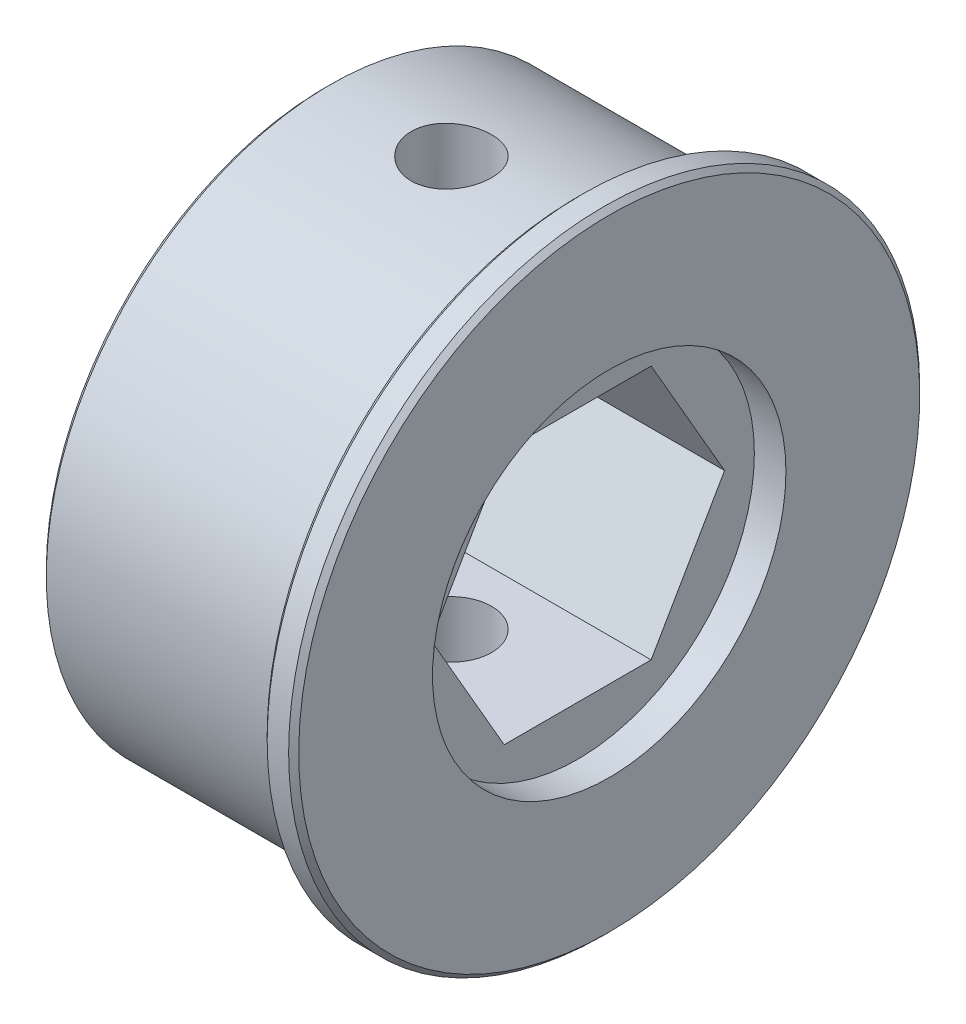
ISO-10303-21;
HEADER;
FILE_DESCRIPTION(('STEP AP214'),'2;1');
FILE_NAME('part.step','',(''),(''),'','','');
FILE_SCHEMA(('AUTOMOTIVE_DESIGN { 1 0 10303 214 1 1 1 1 }'));
ENDSEC;
DATA;
#1=APPLICATION_CONTEXT('core data for automotive mechanical design processes');
#2=APPLICATION_PROTOCOL_DEFINITION('international standard','automotive_design',2000,#1);
#3=PRODUCT_CONTEXT('',#1,'mechanical');
#4=PRODUCT('Part','Part','',(#3));
#5=PRODUCT_RELATED_PRODUCT_CATEGORY('part','',(#4));
#6=PRODUCT_DEFINITION_FORMATION('','',#4);
#7=PRODUCT_DEFINITION_CONTEXT('part definition',#1,'design');
#8=PRODUCT_DEFINITION('design','',#6,#7);
#9=PRODUCT_DEFINITION_SHAPE('','',#8);
#10=(LENGTH_UNIT() NAMED_UNIT(*) SI_UNIT(.MILLI.,.METRE.));
#11=(NAMED_UNIT(*) PLANE_ANGLE_UNIT() SI_UNIT($,.RADIAN.));
#12=(NAMED_UNIT(*) SI_UNIT($,.STERADIAN.) SOLID_ANGLE_UNIT());
#13=UNCERTAINTY_MEASURE_WITH_UNIT(LENGTH_MEASURE(1.E-05),#10,'distance_accuracy_value','');
#14=(GEOMETRIC_REPRESENTATION_CONTEXT(3) GLOBAL_UNCERTAINTY_ASSIGNED_CONTEXT((#13)) GLOBAL_UNIT_ASSIGNED_CONTEXT((#10,
#11,#12)) REPRESENTATION_CONTEXT('',''));
#15=CARTESIAN_POINT('',(0.,0.,0.));
#16=DIRECTION('',(0.,0.,1.));
#17=DIRECTION('',(1.,0.,0.));
#18=AXIS2_PLACEMENT_3D('',#15,#16,#17);
#19=CARTESIAN_POINT('',(1.5875,0.,0.));
#20=DIRECTION('',(1.,0.,0.));
#21=DIRECTION('',(0.,0.,-1.));
#22=AXIS2_PLACEMENT_3D('',#19,#20,#21);
#23=PLANE('',#22);
#24=CARTESIAN_POINT('',(1.5875,0.,0.));
#25=DIRECTION('',(1.,0.,0.));
#26=DIRECTION('',(0.,0.,-1.));
#27=AXIS2_PLACEMENT_3D('',#24,#25,#26);
#28=CIRCLE('',#27,8.89);
#29=CARTESIAN_POINT('',(1.5875,0.,-8.89));
#30=VERTEX_POINT('',#29);
#31=EDGE_CURVE('E27',#30,#30,#28,.F.);
#32=ORIENTED_EDGE('',*,*,#31,.T.);
#33=EDGE_LOOP('',(#32));
#34=FACE_BOUND('',#33,.T.);
#35=CARTESIAN_POINT('',(1.5875,0.,0.));
#36=DIRECTION('',(-1.,0.,0.));
#37=DIRECTION('',(0.,-1.,0.));
#38=AXIS2_PLACEMENT_3D('',#35,#36,#37);
#39=CIRCLE('',#38,15.621);
#40=CARTESIAN_POINT('',(1.5875,-15.621,0.));
#41=VERTEX_POINT('',#40);
#42=EDGE_CURVE('E167',#41,#41,#39,.T.);
#43=ORIENTED_EDGE('',*,*,#42,.F.);
#44=EDGE_LOOP('',(#43));
#45=FACE_BOUND('',#44,.T.);
#46=ADVANCED_FACE('F24',(#34,#45),#23,.T.);
#47=CARTESIAN_POINT('',(-26.7322171389936,0.,0.));
#48=DIRECTION('',(1.,0.,0.));
#49=DIRECTION('',(0.,0.,-1.));
#50=AXIS2_PLACEMENT_3D('',#47,#48,#49);
#51=CYLINDRICAL_SURFACE('',#50,8.89);
#52=CARTESIAN_POINT('',(0.,0.,0.));
#53=DIRECTION('',(1.,0.,0.));
#54=DIRECTION('',(0.,0.,-1.));
#55=AXIS2_PLACEMENT_3D('',#52,#53,#54);
#56=CIRCLE('',#55,8.89);
#57=CARTESIAN_POINT('',(0.,0.,-8.89));
#58=VERTEX_POINT('',#57);
#59=EDGE_CURVE('E90',#58,#58,#56,.T.);
#60=ORIENTED_EDGE('',*,*,#59,.F.);
#61=EDGE_LOOP('',(#60));
#62=FACE_BOUND('',#61,.T.);
#63=ORIENTED_EDGE('',*,*,#31,.F.);
#64=EDGE_LOOP('',(#63));
#65=FACE_BOUND('',#64,.T.);
#66=ADVANCED_FACE('F176',(#62,#65),#51,.F.);
#67=CARTESIAN_POINT('',(1.3335,0.,0.));
#68=DIRECTION('',(-1.,0.,0.));
#69=DIRECTION('',(0.,-1.,0.));
#70=AXIS2_PLACEMENT_3D('',#67,#68,#69);
#71=CONICAL_SURFACE('',#70,15.875,0.785398163397449);
#72=ORIENTED_EDGE('',*,*,#42,.T.);
#73=EDGE_LOOP('',(#72));
#74=FACE_BOUND('',#73,.T.);
#75=CARTESIAN_POINT('',(1.3335,0.,0.));
#76=DIRECTION('',(-1.,0.,0.));
#77=DIRECTION('',(0.,0.,1.));
#78=AXIS2_PLACEMENT_3D('',#75,#76,#77);
#79=CIRCLE('',#78,15.875);
#80=CARTESIAN_POINT('',(1.3335,0.,15.875));
#81=VERTEX_POINT('',#80);
#82=EDGE_CURVE('E108',#81,#81,#79,.T.);
#83=ORIENTED_EDGE('',*,*,#82,.F.);
#84=EDGE_LOOP('',(#83));
#85=FACE_BOUND('',#84,.T.);
#86=ADVANCED_FACE('F178',(#74,#85),#71,.T.);
#87=CARTESIAN_POINT('',(0.,0.,0.));
#88=DIRECTION('',(1.,0.,0.));
#89=DIRECTION('',(0.,0.,-1.));
#90=AXIS2_PLACEMENT_3D('',#87,#88,#89);
#91=PLANE('',#90);
#92=DIRECTION('',(0.,0.,1.));
#93=VECTOR('',#92,1.);
#94=CARTESIAN_POINT('',(0.,6.4008,-3.69550360302896));
#95=LINE('',#94,#93);
#96=CARTESIAN_POINT('',(0.,6.4008,3.69550360302896));
#97=VERTEX_POINT('',#96);
#98=CARTESIAN_POINT('',(0.,6.4008,-3.69550360302896));
#99=VERTEX_POINT('',#98);
#100=EDGE_CURVE('E398',#97,#99,#95,.F.);
#101=ORIENTED_EDGE('',*,*,#100,.T.);
#102=DIRECTION('',(0.,0.866025403784439,0.5));
#103=VECTOR('',#102,1.);
#104=CARTESIAN_POINT('',(0.,0.,-7.39100720605791));
#105=LINE('',#104,#103);
#106=CARTESIAN_POINT('',(0.,0.,-7.39100720605791));
#107=VERTEX_POINT('',#106);
#108=EDGE_CURVE('E74',#99,#107,#105,.F.);
#109=ORIENTED_EDGE('',*,*,#108,.T.);
#110=DIRECTION('',(0.,0.866025403784439,-0.5));
#111=VECTOR('',#110,1.);
#112=CARTESIAN_POINT('',(0.,-6.4008,-3.69550360302896));
#113=LINE('',#112,#111);
#114=CARTESIAN_POINT('',(0.,-6.4008,-3.69550360302896));
#115=VERTEX_POINT('',#114);
#116=EDGE_CURVE('E111',#107,#115,#113,.F.);
#117=ORIENTED_EDGE('',*,*,#116,.T.);
#118=DIRECTION('',(0.,0.,-1.));
#119=VECTOR('',#118,1.);
#120=CARTESIAN_POINT('',(0.,-6.4008,3.69550360302896));
#121=LINE('',#120,#119);
#122=CARTESIAN_POINT('',(0.,-6.4008,3.69550360302896));
#123=VERTEX_POINT('',#122);
#124=EDGE_CURVE('E86',#115,#123,#121,.F.);
#125=ORIENTED_EDGE('',*,*,#124,.T.);
#126=DIRECTION('',(0.,-0.866025403784439,-0.5));
#127=VECTOR('',#126,1.);
#128=CARTESIAN_POINT('',(0.,0.,7.39100720605791));
#129=LINE('',#128,#127);
#130=CARTESIAN_POINT('',(0.,0.,7.39100720605791));
#131=VERTEX_POINT('',#130);
#132=EDGE_CURVE('E78',#123,#131,#129,.F.);
#133=ORIENTED_EDGE('',*,*,#132,.T.);
#134=DIRECTION('',(0.,-0.866025403784439,0.5));
#135=VECTOR('',#134,1.);
#136=CARTESIAN_POINT('',(0.,6.4008,3.69550360302896));
#137=LINE('',#136,#135);
#138=EDGE_CURVE('E83',#131,#97,#137,.F.);
#139=ORIENTED_EDGE('',*,*,#138,.T.);
#140=EDGE_LOOP('',(#101,#109,#117,#125,#133,#139));
#141=FACE_BOUND('',#140,.T.);
#142=ORIENTED_EDGE('',*,*,#59,.T.);
#143=EDGE_LOOP('',(#142));
#144=FACE_BOUND('',#143,.T.);
#145=ADVANCED_FACE('F80',(#141,#144),#91,.T.);
#146=CARTESIAN_POINT('',(-12.7,0.,7.39100720605791));
#147=DIRECTION('',(0.,-0.5,0.866025403784439));
#148=DIRECTION('',(0.,-0.866025403784439,-0.5));
#149=AXIS2_PLACEMENT_3D('',#146,#147,#148);
#150=PLANE('',#149);
#151=DIRECTION('',(1.,0.,0.));
#152=VECTOR('',#151,1.);
#153=CARTESIAN_POINT('',(-12.7,-6.4008,3.69550360302896));
#154=LINE('',#153,#152);
#155=CARTESIAN_POINT('',(-12.7,-6.4008,3.69550360302896));
#156=VERTEX_POINT('',#155);
#157=EDGE_CURVE('E110',#123,#156,#154,.F.);
#158=ORIENTED_EDGE('',*,*,#157,.T.);
#159=DIRECTION('',(0.,0.866025403784439,0.5));
#160=VECTOR('',#159,1.);
#161=CARTESIAN_POINT('',(-12.7,-6.4008,3.69550360302896));
#162=LINE('',#161,#160);
#163=CARTESIAN_POINT('',(-12.7,0.,7.39100720605791));
#164=VERTEX_POINT('',#163);
#165=EDGE_CURVE('E95',#156,#164,#162,.T.);
#166=ORIENTED_EDGE('',*,*,#165,.T.);
#167=DIRECTION('',(1.,0.,0.));
#168=VECTOR('',#167,1.);
#169=CARTESIAN_POINT('',(-12.7,0.,7.39100720605791));
#170=LINE('',#169,#168);
#171=EDGE_CURVE('E89',#164,#131,#170,.T.);
#172=ORIENTED_EDGE('',*,*,#171,.T.);
#173=ORIENTED_EDGE('',*,*,#132,.F.);
#174=EDGE_LOOP('',(#158,#166,#172,#173));
#175=FACE_BOUND('',#174,.T.);
#176=ADVANCED_FACE('F93',(#175),#150,.F.);
#177=CARTESIAN_POINT('',(-12.7,6.4008,3.69550360302896));
#178=DIRECTION('',(0.,0.5,0.866025403784439));
#179=DIRECTION('',(0.,-0.866025403784439,0.5));
#180=AXIS2_PLACEMENT_3D('',#177,#178,#179);
#181=PLANE('',#180);
#182=ORIENTED_EDGE('',*,*,#171,.F.);
#183=DIRECTION('',(0.,0.866025403784439,-0.5));
#184=VECTOR('',#183,1.);
#185=CARTESIAN_POINT('',(-12.7,0.,7.39100720605791));
#186=LINE('',#185,#184);
#187=CARTESIAN_POINT('',(-12.7,6.4008,3.69550360302896));
#188=VERTEX_POINT('',#187);
#189=EDGE_CURVE('E401',#164,#188,#186,.T.);
#190=ORIENTED_EDGE('',*,*,#189,.T.);
#191=DIRECTION('',(1.,0.,0.));
#192=VECTOR('',#191,1.);
#193=CARTESIAN_POINT('',(-12.7,6.4008,3.69550360302896));
#194=LINE('',#193,#192);
#195=EDGE_CURVE('E101',#188,#97,#194,.T.);
#196=ORIENTED_EDGE('',*,*,#195,.T.);
#197=ORIENTED_EDGE('',*,*,#138,.F.);
#198=EDGE_LOOP('',(#182,#190,#196,#197));
#199=FACE_BOUND('',#198,.T.);
#200=ADVANCED_FACE('F99',(#199),#181,.F.);
#201=CARTESIAN_POINT('',(-12.7,0.,-7.39100720605791));
#202=DIRECTION('',(0.,0.5,-0.866025403784439));
#203=DIRECTION('',(0.,0.866025403784439,0.5));
#204=AXIS2_PLACEMENT_3D('',#201,#202,#203);
#205=PLANE('',#204);
#206=DIRECTION('',(1.,0.,0.));
#207=VECTOR('',#206,1.);
#208=CARTESIAN_POINT('',(-12.7,6.4008,-3.69550360302896));
#209=LINE('',#208,#207);
#210=CARTESIAN_POINT('',(-12.7,6.4008,-3.69550360302896));
#211=VERTEX_POINT('',#210);
#212=EDGE_CURVE('E393',#99,#211,#209,.F.);
#213=ORIENTED_EDGE('',*,*,#212,.T.);
#214=DIRECTION('',(0.,-0.866025403784438,-0.5));
#215=VECTOR('',#214,1.);
#216=CARTESIAN_POINT('',(-12.7,6.4008,-3.69550360302896));
#217=LINE('',#216,#215);
#218=CARTESIAN_POINT('',(-12.7,0.,-7.39100720605791));
#219=VERTEX_POINT('',#218);
#220=EDGE_CURVE('E390',#211,#219,#217,.T.);
#221=ORIENTED_EDGE('',*,*,#220,.T.);
#222=DIRECTION('',(1.,0.,0.));
#223=VECTOR('',#222,1.);
#224=CARTESIAN_POINT('',(-12.7,0.,-7.39100720605791));
#225=LINE('',#224,#223);
#226=EDGE_CURVE('E104',#219,#107,#225,.T.);
#227=ORIENTED_EDGE('',*,*,#226,.T.);
#228=ORIENTED_EDGE('',*,*,#108,.F.);
#229=EDGE_LOOP('',(#213,#221,#227,#228));
#230=FACE_BOUND('',#229,.T.);
#231=ADVANCED_FACE('F193',(#230),#205,.F.);
#232=CARTESIAN_POINT('',(-12.7,-6.4008,-3.69550360302896));
#233=DIRECTION('',(0.,-0.5,-0.866025403784439));
#234=DIRECTION('',(0.,0.866025403784439,-0.5));
#235=AXIS2_PLACEMENT_3D('',#232,#233,#234);
#236=PLANE('',#235);
#237=ORIENTED_EDGE('',*,*,#226,.F.);
#238=DIRECTION('',(0.,-0.866025403784439,0.5));
#239=VECTOR('',#238,1.);
#240=CARTESIAN_POINT('',(-12.7,0.,-7.39100720605791));
#241=LINE('',#240,#239);
#242=CARTESIAN_POINT('',(-12.7,-6.4008,-3.69550360302896));
#243=VERTEX_POINT('',#242);
#244=EDGE_CURVE('E42',#219,#243,#241,.T.);
#245=ORIENTED_EDGE('',*,*,#244,.T.);
#246=DIRECTION('',(1.,0.,0.));
#247=VECTOR('',#246,1.);
#248=CARTESIAN_POINT('',(-12.7,-6.4008,-3.69550360302896));
#249=LINE('',#248,#247);
#250=EDGE_CURVE('E391',#243,#115,#249,.T.);
#251=ORIENTED_EDGE('',*,*,#250,.T.);
#252=ORIENTED_EDGE('',*,*,#116,.F.);
#253=EDGE_LOOP('',(#237,#245,#251,#252));
#254=FACE_BOUND('',#253,.T.);
#255=ADVANCED_FACE('F196',(#254),#236,.F.);
#256=CARTESIAN_POINT('',(1.5875,0.,0.));
#257=DIRECTION('',(-1.,0.,0.));
#258=DIRECTION('',(0.,0.,1.));
#259=AXIS2_PLACEMENT_3D('',#256,#257,#258);
#260=CYLINDRICAL_SURFACE('',#259,15.875);
#261=ORIENTED_EDGE('',*,*,#82,.T.);
#262=EDGE_LOOP('',(#261));
#263=FACE_BOUND('',#262,.T.);
#264=CARTESIAN_POINT('',(0.253999999999997,0.,0.));
#265=DIRECTION('',(1.,0.,0.));
#266=DIRECTION('',(0.,0.,-1.));
#267=AXIS2_PLACEMENT_3D('',#264,#265,#266);
#268=CIRCLE('',#267,15.875);
#269=CARTESIAN_POINT('',(0.253999999999997,0.,-15.875));
#270=VERTEX_POINT('',#269);
#271=EDGE_CURVE('E165',#270,#270,#268,.F.);
#272=ORIENTED_EDGE('',*,*,#271,.F.);
#273=EDGE_LOOP('',(#272));
#274=FACE_BOUND('',#273,.T.);
#275=ADVANCED_FACE('F200',(#263,#274),#260,.T.);
#276=CARTESIAN_POINT('',(-12.7,-6.4008,3.69550360302896));
#277=DIRECTION('',(0.,-1.,0.));
#278=DIRECTION('',(0.,0.,-1.));
#279=AXIS2_PLACEMENT_3D('',#276,#277,#278);
#280=PLANE('',#279);
#281=ORIENTED_EDGE('',*,*,#250,.F.);
#282=DIRECTION('',(0.,0.,-1.));
#283=VECTOR('',#282,1.);
#284=CARTESIAN_POINT('',(-12.7,-6.4008,0.));
#285=LINE('',#284,#283);
#286=EDGE_CURVE('E381',#243,#156,#285,.F.);
#287=ORIENTED_EDGE('',*,*,#286,.T.);
#288=ORIENTED_EDGE('',*,*,#157,.F.);
#289=ORIENTED_EDGE('',*,*,#124,.F.);
#290=EDGE_LOOP('',(#281,#287,#288,#289));
#291=FACE_BOUND('',#290,.T.);
#292=CARTESIAN_POINT('',(-6.35,-6.4008,0.));
#293=DIRECTION('',(0.,-1.,0.));
#294=DIRECTION('',(0.,0.,-1.));
#295=AXIS2_PLACEMENT_3D('',#292,#293,#294);
#296=CIRCLE('',#295,2.01929999999999);
#297=CARTESIAN_POINT('',(-6.35,-6.4008,-2.01929999999999));
#298=VERTEX_POINT('',#297);
#299=EDGE_CURVE('E160',#298,#298,#296,.T.);
#300=ORIENTED_EDGE('',*,*,#299,.T.);
#301=EDGE_LOOP('',(#300));
#302=FACE_BOUND('',#301,.T.);
#303=ADVANCED_FACE('F203',(#291,#302),#280,.F.);
#304=CARTESIAN_POINT('',(-12.7,6.4008,-3.69550360302896));
#305=DIRECTION('',(0.,1.,0.));
#306=DIRECTION('',(0.,0.,1.));
#307=AXIS2_PLACEMENT_3D('',#304,#305,#306);
#308=PLANE('',#307);
#309=ORIENTED_EDGE('',*,*,#195,.F.);
#310=DIRECTION('',(0.,0.,-1.));
#311=VECTOR('',#310,1.);
#312=CARTESIAN_POINT('',(-12.7,6.4008,0.));
#313=LINE('',#312,#311);
#314=EDGE_CURVE('E403',#188,#211,#313,.T.);
#315=ORIENTED_EDGE('',*,*,#314,.T.);
#316=ORIENTED_EDGE('',*,*,#212,.F.);
#317=ORIENTED_EDGE('',*,*,#100,.F.);
#318=EDGE_LOOP('',(#309,#315,#316,#317));
#319=FACE_BOUND('',#318,.T.);
#320=CARTESIAN_POINT('',(-6.35,6.4008,0.));
#321=DIRECTION('',(0.,1.,0.));
#322=DIRECTION('',(0.,0.,1.));
#323=AXIS2_PLACEMENT_3D('',#320,#321,#322);
#324=CIRCLE('',#323,2.01929999999999);
#325=CARTESIAN_POINT('',(-6.35,6.4008,2.01929999999999));
#326=VERTEX_POINT('',#325);
#327=EDGE_CURVE('E156',#326,#326,#324,.T.);
#328=ORIENTED_EDGE('',*,*,#327,.T.);
#329=EDGE_LOOP('',(#328));
#330=FACE_BOUND('',#329,.T.);
#331=ADVANCED_FACE('F207',(#319,#330),#308,.F.);
#332=CARTESIAN_POINT('',(-12.7,0.,0.));
#333=DIRECTION('',(1.,0.,0.));
#334=DIRECTION('',(0.,0.,-1.));
#335=AXIS2_PLACEMENT_3D('',#332,#333,#334);
#336=PLANE('',#335);
#337=ORIENTED_EDGE('',*,*,#244,.F.);
#338=ORIENTED_EDGE('',*,*,#220,.F.);
#339=ORIENTED_EDGE('',*,*,#314,.F.);
#340=ORIENTED_EDGE('',*,*,#189,.F.);
#341=ORIENTED_EDGE('',*,*,#165,.F.);
#342=ORIENTED_EDGE('',*,*,#286,.F.);
#343=EDGE_LOOP('',(#337,#338,#339,#340,#341,#342));
#344=FACE_BOUND('',#343,.T.);
#345=CARTESIAN_POINT('',(-12.7,0.,0.));
#346=DIRECTION('',(1.,0.,0.));
#347=DIRECTION('',(0.,0.,-1.));
#348=AXIS2_PLACEMENT_3D('',#345,#346,#347);
#349=CIRCLE('',#348,14.0335);
#350=CARTESIAN_POINT('',(-12.7,0.,-14.0335));
#351=VERTEX_POINT('',#350);
#352=EDGE_CURVE('E153',#351,#351,#349,.T.);
#353=ORIENTED_EDGE('',*,*,#352,.F.);
#354=EDGE_LOOP('',(#353));
#355=FACE_BOUND('',#354,.T.);
#356=ADVANCED_FACE('F211',(#344,#355),#336,.F.);
#357=CARTESIAN_POINT('',(0.253999999999997,0.,0.));
#358=DIRECTION('',(1.,0.,0.));
#359=DIRECTION('',(0.,0.,-1.));
#360=AXIS2_PLACEMENT_3D('',#357,#358,#359);
#361=CONICAL_SURFACE('',#360,15.875,0.785398163397462);
#362=CARTESIAN_POINT('',(0.,0.,0.));
#363=DIRECTION('',(1.,0.,0.));
#364=DIRECTION('',(0.,0.,-1.));
#365=AXIS2_PLACEMENT_3D('',#362,#363,#364);
#366=CIRCLE('',#365,15.621);
#367=CARTESIAN_POINT('',(0.,0.,-15.621));
#368=VERTEX_POINT('',#367);
#369=EDGE_CURVE('E155',#368,#368,#366,.T.);
#370=ORIENTED_EDGE('',*,*,#369,.T.);
#371=EDGE_LOOP('',(#370));
#372=FACE_BOUND('',#371,.T.);
#373=ORIENTED_EDGE('',*,*,#271,.T.);
#374=EDGE_LOOP('',(#373));
#375=FACE_BOUND('',#374,.T.);
#376=ADVANCED_FACE('F215',(#372,#375),#361,.T.);
#377=CARTESIAN_POINT('',(-6.35,-14.2875,0.));
#378=DIRECTION('',(0.,-1.,0.));
#379=DIRECTION('',(0.,0.,-1.));
#380=AXIS2_PLACEMENT_3D('',#377,#378,#379);
#381=CYLINDRICAL_SURFACE('',#380,2.01929999999999);
#382=CARTESIAN_POINT('',(-6.35,-14.144082994666,-2.01929999999999));
#383=CARTESIAN_POINT('',(-6.46270978043252,-14.1440848572454,-2.01929494830352));
#384=CARTESIAN_POINT('',(-6.57556587894467,-14.1454458805024,-2.00982386080185));
#385=CARTESIAN_POINT('',(-6.7982088924763,-14.1507430375104,-1.97217534297388));
#386=CARTESIAN_POINT('',(-6.90798898861305,-14.1546844828974,-1.94395932562443));
#387=CARTESIAN_POINT('',(-7.12110470893202,-14.1646874218911,-1.86967410443429));
#388=CARTESIAN_POINT('',(-7.22444753490229,-14.1707464942905,-1.82362528341692));
#389=CARTESIAN_POINT('',(-7.42189406589666,-14.1842985714464,-1.71502478847225));
#390=CARTESIAN_POINT('',(-7.51600143849081,-14.1917910034744,-1.6524797022028));
#391=CARTESIAN_POINT('',(-7.69303462417489,-14.2074272342722,-1.51217328150928));
#392=CARTESIAN_POINT('',(-7.77588421230662,-14.2155749310997,-1.43431618488559));
#393=CARTESIAN_POINT('',(-7.92739205174378,-14.2315690971988,-1.26579893156019));
#394=CARTESIAN_POINT('',(-7.99604883392367,-14.2394155352181,-1.17513745108457));
#395=CARTESIAN_POINT('',(-8.11749018201473,-14.2539623529557,-0.98311220214005));
#396=CARTESIAN_POINT('',(-8.1702063573829,-14.2606577427863,-0.881704771543283));
#397=CARTESIAN_POINT('',(-8.25783082400248,-14.2721058154367,-0.671365971979824));
#398=CARTESIAN_POINT('',(-8.29274010812396,-14.2768586065682,-0.562435022891319));
#399=CARTESIAN_POINT('',(-8.34353419968074,-14.2838590054793,-0.340911595459711));
#400=CARTESIAN_POINT('',(-8.35954437028774,-14.28612311441,-0.228348392070303));
#401=CARTESIAN_POINT('',(-8.37247474096552,-14.2879475293366,-0.00211168387442402));
#402=CARTESIAN_POINT('',(-8.36939585590121,-14.2875079649092,0.111561767461445));
#403=CARTESIAN_POINT('',(-8.34433505905639,-14.2839878101692,0.335936542663667));
#404=CARTESIAN_POINT('',(-8.32248816809108,-14.2809260846932,0.446653285103089));
#405=CARTESIAN_POINT('',(-8.26072280300443,-14.272526639762,0.662834215513374));
#406=CARTESIAN_POINT('',(-8.2208037520711,-14.2671888476616,0.768298235713002));
#407=CARTESIAN_POINT('',(-8.12388550625377,-14.2548043308748,0.971394358653127));
#408=CARTESIAN_POINT('',(-8.06682832552566,-14.247751820225,1.06899842301094));
#409=CARTESIAN_POINT('',(-7.93730058817925,-14.2327257552402,1.25328969037924));
#410=CARTESIAN_POINT('',(-7.86483035509148,-14.2247522202398,1.3399771224765));
#411=CARTESIAN_POINT('',(-7.70579446431181,-14.2086932563854,1.5007629286406));
#412=CARTESIAN_POINT('',(-7.61911362555077,-14.200607453654,1.57474736975061));
#413=CARTESIAN_POINT('',(-7.43445909511833,-14.1852981969896,1.70717057678363));
#414=CARTESIAN_POINT('',(-7.3364802927051,-14.1780751363578,1.76560226741946));
#415=CARTESIAN_POINT('',(-7.13187256086239,-14.1653086919635,1.8652679033142));
#416=CARTESIAN_POINT('',(-7.02523133128519,-14.1597677514924,1.90647686483089));
#417=CARTESIAN_POINT('',(-6.80658871275593,-14.1510314499486,1.97028383212602));
#418=CARTESIAN_POINT('',(-6.69459920164276,-14.1478311271646,1.99292121896487));
#419=CARTESIAN_POINT('',(-6.5431885987086,-14.1453494339129,2.01041173449661));
#420=CARTESIAN_POINT('',(-6.50463245316409,-14.1448755243254,2.0137422538627));
#421=CARTESIAN_POINT('',(-6.42738995630406,-14.1442419848102,2.01818725463624));
#422=CARTESIAN_POINT('',(-6.38870360491022,-14.1440823550717,2.01930173471071));
#423=CARTESIAN_POINT('',(-6.23729021956748,-14.1440848572454,2.01929494830352));
#424=CARTESIAN_POINT('',(-6.12443412105533,-14.1454458805024,2.00982386080186));
#425=CARTESIAN_POINT('',(-5.9017911075237,-14.1507430375104,1.97217534297388));
#426=CARTESIAN_POINT('',(-5.79201101138695,-14.1546844828974,1.94395932562443));
#427=CARTESIAN_POINT('',(-5.57889529106798,-14.1646874218911,1.86967410443429));
#428=CARTESIAN_POINT('',(-5.47555246509771,-14.1707464942905,1.82362528341692));
#429=CARTESIAN_POINT('',(-5.27810593410334,-14.1842985714464,1.71502478847225));
#430=CARTESIAN_POINT('',(-5.18399856150919,-14.1917910034744,1.6524797022028));
#431=CARTESIAN_POINT('',(-5.00696537582511,-14.2074272342722,1.51217328150928));
#432=CARTESIAN_POINT('',(-4.92411578769338,-14.2155749310997,1.43431618488559));
#433=CARTESIAN_POINT('',(-4.77260794825622,-14.2315690971988,1.2657989315602));
#434=CARTESIAN_POINT('',(-4.70395116607633,-14.2394155352181,1.17513745108457));
#435=CARTESIAN_POINT('',(-4.58250981798527,-14.2539623529557,0.983112202140052));
#436=CARTESIAN_POINT('',(-4.5297936426171,-14.2606577427863,0.881704771543285));
#437=CARTESIAN_POINT('',(-4.44216917599753,-14.2721058154367,0.671365971979826));
#438=CARTESIAN_POINT('',(-4.40725989187604,-14.2768586065682,0.562435022891321));
#439=CARTESIAN_POINT('',(-4.35646580031926,-14.2838590054793,0.340911595459712));
#440=CARTESIAN_POINT('',(-4.34045562971226,-14.28612311441,0.228348392070305));
#441=CARTESIAN_POINT('',(-4.32752525903448,-14.2879475293366,0.00211168387442621));
#442=CARTESIAN_POINT('',(-4.33060414409878,-14.2875079649092,-0.111561767461443));
#443=CARTESIAN_POINT('',(-4.35566494094361,-14.2839878101692,-0.335936542663665));
#444=CARTESIAN_POINT('',(-4.37751183190892,-14.2809260846932,-0.446653285103087));
#445=CARTESIAN_POINT('',(-4.43927719699557,-14.272526639762,-0.662834215513372));
#446=CARTESIAN_POINT('',(-4.4791962479289,-14.2671888476616,-0.768298235713));
#447=CARTESIAN_POINT('',(-4.57611449374623,-14.2548043308748,-0.971394358653125));
#448=CARTESIAN_POINT('',(-4.63317167447434,-14.247751820225,-1.06899842301094));
#449=CARTESIAN_POINT('',(-4.76269941182075,-14.2327257552402,-1.25328969037923));
#450=CARTESIAN_POINT('',(-4.83516964490852,-14.2247522202398,-1.3399771224765));
#451=CARTESIAN_POINT('',(-4.99420553568819,-14.2086932563854,-1.5007629286406));
#452=CARTESIAN_POINT('',(-5.08088637444923,-14.200607453654,-1.57474736975061));
#453=CARTESIAN_POINT('',(-5.26554090488167,-14.1852981969896,-1.70717057678363));
#454=CARTESIAN_POINT('',(-5.3635197072949,-14.1780751363578,-1.76560226741946));
#455=CARTESIAN_POINT('',(-5.56812743913761,-14.1653086919635,-1.8652679033142));
#456=CARTESIAN_POINT('',(-5.67476866871481,-14.1597677514924,-1.90647686483089));
#457=CARTESIAN_POINT('',(-5.89341128724408,-14.1510314499486,-1.97028383212601));
#458=CARTESIAN_POINT('',(-6.00540079835724,-14.1478311271646,-1.99292121896487));
#459=CARTESIAN_POINT('',(-6.1568114012914,-14.1453494339129,-2.0104117344966));
#460=CARTESIAN_POINT('',(-6.19536754683591,-14.1448755243254,-2.0137422538627));
#461=CARTESIAN_POINT('',(-6.27261004369594,-14.1442419848102,-2.01818725463624));
#462=CARTESIAN_POINT('',(-6.31129639508978,-14.1440823550717,-2.01930173471071));
#463=CARTESIAN_POINT('',(-6.35,-14.144082994666,-2.01929999999999));
#464=B_SPLINE_CURVE_WITH_KNOTS('',3,(#382,#383,#384,#385,#386,#387,#388,#389,#390,#391,#392,
#393,#394,#395,#396,#397,#398,#399,#400,#401,#402,#403,#404,#405,#406,#407,#408,#409,#410,#411,
#412,#413,#414,#415,#416,#417,#418,#419,#420,#421,#422,#423,#424,#425,#426,#427,#428,#429,#430,
#431,#432,#433,#434,#435,#436,#437,#438,#439,#440,#441,#442,#443,#444,#445,#446,#447,#448,#449,
#450,#451,#452,#453,#454,#455,#456,#457,#458,#459,#460,#461,#462,#463),.UNSPECIFIED.,.T.,.F.,(4,
2,2,2,2,2,2,2,2,2,2,2,2,2,2,2,2,2,2,2,2,2,2,2,2,2,2,2,2,2,2,2,2,2,2,2,2,2,2,2,4),(0.,
0.337981725405059,0.676661361564413,1.01495502540221,1.35311379825344,1.69345884511456,
2.03383910414603,2.37565963920306,2.71746111307282,3.05698234773836,3.39648731058473,
3.73357006716555,4.07066358322854,4.40891073452933,4.74715078649165,5.08828181598833,
5.42956776925378,5.77134709676019,6.11239979348322,6.22845984832776,6.34451997298378,
6.68250169838884,7.0211813345482,7.359474998386,7.69763377123723,8.03797881809834,
8.37835907712982,8.72017961218684,9.0619810860566,9.40150232072215,9.74100728356852,
10.0780900401493,10.4151835562123,10.7534307075131,11.0916707594754,11.4328017889721,
11.7740877422376,12.115867069744,12.456919766467,12.5729798213115,12.6890399459676),.UNSPECIFIED.);
#465=CARTESIAN_POINT('',(-6.35,-14.144082994666,-2.01929999999999));
#466=VERTEX_POINT('',#465);
#467=EDGE_CURVE('E121',#466,#466,#464,.T.);
#468=ORIENTED_EDGE('',*,*,#467,.F.);
#469=EDGE_LOOP('',(#468));
#470=FACE_BOUND('',#469,.T.);
#471=ORIENTED_EDGE('',*,*,#299,.F.);
#472=EDGE_LOOP('',(#471));
#473=FACE_BOUND('',#472,.T.);
#474=ADVANCED_FACE('F146',(#470,#473),#381,.F.);
#475=CARTESIAN_POINT('',(-6.35,14.2875,0.));
#476=DIRECTION('',(0.,1.,0.));
#477=DIRECTION('',(0.,0.,1.));
#478=AXIS2_PLACEMENT_3D('',#475,#476,#477);
#479=CYLINDRICAL_SURFACE('',#478,2.01929999999999);
#480=CARTESIAN_POINT('',(-6.35,14.144082994666,-2.01929999999999));
#481=CARTESIAN_POINT('',(-6.23729021956748,14.1440848572454,-2.01929494830352));
#482=CARTESIAN_POINT('',(-6.12443412105533,14.1454458805024,-2.00982386080186));
#483=CARTESIAN_POINT('',(-5.9017911075237,14.1507430375104,-1.97217534297388));
#484=CARTESIAN_POINT('',(-5.79201101138695,14.1546844828974,-1.94395932562443));
#485=CARTESIAN_POINT('',(-5.57889529106798,14.1646874218911,-1.86967410443429));
#486=CARTESIAN_POINT('',(-5.47555246509771,14.1707464942905,-1.82362528341692));
#487=CARTESIAN_POINT('',(-5.27810593410334,14.1842985714464,-1.71502478847225));
#488=CARTESIAN_POINT('',(-5.18399856150919,14.1917910034744,-1.6524797022028));
#489=CARTESIAN_POINT('',(-5.00696537582511,14.2074272342722,-1.51217328150928));
#490=CARTESIAN_POINT('',(-4.92411578769338,14.2155749310997,-1.43431618488559));
#491=CARTESIAN_POINT('',(-4.77260794825622,14.2315690971988,-1.26579893156019));
#492=CARTESIAN_POINT('',(-4.70395116607633,14.2394155352181,-1.17513745108457));
#493=CARTESIAN_POINT('',(-4.58250981798527,14.2539623529557,-0.983112202140052));
#494=CARTESIAN_POINT('',(-4.5297936426171,14.2606577427863,-0.881704771543284));
#495=CARTESIAN_POINT('',(-4.44216917599752,14.2721058154367,-0.671365971979824));
#496=CARTESIAN_POINT('',(-4.40725989187604,14.2768586065682,-0.562435022891319));
#497=CARTESIAN_POINT('',(-4.35646580031926,14.2838590054793,-0.340911595459711));
#498=CARTESIAN_POINT('',(-4.34045562971226,14.28612311441,-0.228348392070304));
#499=CARTESIAN_POINT('',(-4.32752525903448,14.2879475293366,-0.0021116838744249));
#500=CARTESIAN_POINT('',(-4.33060414409878,14.2875079649092,0.111561767461444));
#501=CARTESIAN_POINT('',(-4.35566494094361,14.2839878101692,0.335936542663666));
#502=CARTESIAN_POINT('',(-4.37751183190892,14.2809260846932,0.446653285103088));
#503=CARTESIAN_POINT('',(-4.43927719699557,14.272526639762,0.662834215513373));
#504=CARTESIAN_POINT('',(-4.4791962479289,14.2671888476616,0.768298235713002));
#505=CARTESIAN_POINT('',(-4.57611449374623,14.2548043308748,0.971394358653126));
#506=CARTESIAN_POINT('',(-4.63317167447434,14.247751820225,1.06899842301094));
#507=CARTESIAN_POINT('',(-4.76269941182074,14.2327257552402,1.25328969037924));
#508=CARTESIAN_POINT('',(-4.83516964490852,14.2247522202398,1.3399771224765));
#509=CARTESIAN_POINT('',(-4.99420553568819,14.2086932563854,1.5007629286406));
#510=CARTESIAN_POINT('',(-5.08088637444923,14.200607453654,1.57474736975061));
#511=CARTESIAN_POINT('',(-5.26554090488167,14.1852981969896,1.70717057678363));
#512=CARTESIAN_POINT('',(-5.3635197072949,14.1780751363578,1.76560226741946));
#513=CARTESIAN_POINT('',(-5.56812743913761,14.1653086919635,1.8652679033142));
#514=CARTESIAN_POINT('',(-5.67476866871481,14.1597677514924,1.90647686483089));
#515=CARTESIAN_POINT('',(-5.89341128724408,14.1510314499486,1.97028383212602));
#516=CARTESIAN_POINT('',(-6.00540079835724,14.1478311271646,1.99292121896487));
#517=CARTESIAN_POINT('',(-6.1568114012914,14.1453494339129,2.01041173449661));
#518=CARTESIAN_POINT('',(-6.19536754683591,14.1448755243254,2.0137422538627));
#519=CARTESIAN_POINT('',(-6.27261004369594,14.1442419848102,2.01818725463624));
#520=CARTESIAN_POINT('',(-6.31129639508978,14.1440823550717,2.01930173471071));
#521=CARTESIAN_POINT('',(-6.46270978043252,14.1440848572454,2.01929494830352));
#522=CARTESIAN_POINT('',(-6.57556587894467,14.1454458805024,2.00982386080186));
#523=CARTESIAN_POINT('',(-6.7982088924763,14.1507430375104,1.97217534297388));
#524=CARTESIAN_POINT('',(-6.90798898861305,14.1546844828974,1.94395932562443));
#525=CARTESIAN_POINT('',(-7.12110470893202,14.1646874218911,1.8696741044343));
#526=CARTESIAN_POINT('',(-7.22444753490229,14.1707464942905,1.82362528341692));
#527=CARTESIAN_POINT('',(-7.42189406589666,14.1842985714464,1.71502478847225));
#528=CARTESIAN_POINT('',(-7.51600143849081,14.1917910034744,1.6524797022028));
#529=CARTESIAN_POINT('',(-7.69303462417489,14.2074272342722,1.51217328150928));
#530=CARTESIAN_POINT('',(-7.77588421230662,14.2155749310997,1.4343161848856));
#531=CARTESIAN_POINT('',(-7.92739205174377,14.2315690971988,1.2657989315602));
#532=CARTESIAN_POINT('',(-7.99604883392367,14.2394155352181,1.17513745108457));
#533=CARTESIAN_POINT('',(-8.11749018201473,14.2539623529557,0.983112202140053));
#534=CARTESIAN_POINT('',(-8.1702063573829,14.2606577427863,0.881704771543285));
#535=CARTESIAN_POINT('',(-8.25783082400248,14.2721058154367,0.671365971979825));
#536=CARTESIAN_POINT('',(-8.29274010812396,14.2768586065682,0.562435022891321));
#537=CARTESIAN_POINT('',(-8.34353419968074,14.2838590054793,0.340911595459713));
#538=CARTESIAN_POINT('',(-8.35954437028774,14.28612311441,0.228348392070306));
#539=CARTESIAN_POINT('',(-8.37247474096552,14.2879475293366,0.0021116838744262));
#540=CARTESIAN_POINT('',(-8.36939585590122,14.2875079649092,-0.111561767461443));
#541=CARTESIAN_POINT('',(-8.34433505905639,14.2839878101692,-0.335936542663665));
#542=CARTESIAN_POINT('',(-8.32248816809108,14.2809260846932,-0.446653285103087));
#543=CARTESIAN_POINT('',(-8.26072280300443,14.272526639762,-0.662834215513372));
#544=CARTESIAN_POINT('',(-8.2208037520711,14.2671888476616,-0.768298235713001));
#545=CARTESIAN_POINT('',(-8.12388550625377,14.2548043308748,-0.971394358653125));
#546=CARTESIAN_POINT('',(-8.06682832552566,14.247751820225,-1.06899842301094));
#547=CARTESIAN_POINT('',(-7.93730058817925,14.2327257552402,-1.25328969037924));
#548=CARTESIAN_POINT('',(-7.86483035509148,14.2247522202398,-1.3399771224765));
#549=CARTESIAN_POINT('',(-7.70579446431181,14.2086932563854,-1.5007629286406));
#550=CARTESIAN_POINT('',(-7.61911362555077,14.200607453654,-1.57474736975061));
#551=CARTESIAN_POINT('',(-7.43445909511833,14.1852981969896,-1.70717057678363));
#552=CARTESIAN_POINT('',(-7.3364802927051,14.1780751363578,-1.76560226741946));
#553=CARTESIAN_POINT('',(-7.13187256086239,14.1653086919635,-1.8652679033142));
#554=CARTESIAN_POINT('',(-7.02523133128519,14.1597677514924,-1.90647686483089));
#555=CARTESIAN_POINT('',(-6.80658871275593,14.1510314499486,-1.97028383212601));
#556=CARTESIAN_POINT('',(-6.69459920164276,14.1478311271646,-1.99292121896487));
#557=CARTESIAN_POINT('',(-6.5431885987086,14.1453494339129,-2.01041173449661));
#558=CARTESIAN_POINT('',(-6.50463245316409,14.1448755243254,-2.0137422538627));
#559=CARTESIAN_POINT('',(-6.42738995630406,14.1442419848102,-2.01818725463624));
#560=CARTESIAN_POINT('',(-6.38870360491022,14.1440823550717,-2.01930173471071));
#561=CARTESIAN_POINT('',(-6.35,14.144082994666,-2.01929999999999));
#562=B_SPLINE_CURVE_WITH_KNOTS('',3,(#480,#481,#482,#483,#484,#485,#486,#487,#488,#489,#490,
#491,#492,#493,#494,#495,#496,#497,#498,#499,#500,#501,#502,#503,#504,#505,#506,#507,#508,#509,
#510,#511,#512,#513,#514,#515,#516,#517,#518,#519,#520,#521,#522,#523,#524,#525,#526,#527,#528,
#529,#530,#531,#532,#533,#534,#535,#536,#537,#538,#539,#540,#541,#542,#543,#544,#545,#546,#547,
#548,#549,#550,#551,#552,#553,#554,#555,#556,#557,#558,#559,#560,#561),.UNSPECIFIED.,.T.,.F.,(4,
2,2,2,2,2,2,2,2,2,2,2,2,2,2,2,2,2,2,2,2,2,2,2,2,2,2,2,2,2,2,2,2,2,2,2,2,2,2,2,4),(0.,
0.337981725405059,0.676661361564413,1.01495502540221,1.35311379825344,1.69345884511455,
2.03383910414603,2.37565963920306,2.71746111307282,3.05698234773836,3.39648731058473,
3.73357006716555,4.07066358322854,4.40891073452933,4.74715078649165,5.08828181598833,
5.42956776925378,5.7713470967602,6.11239979348322,6.22845984832776,6.34451997298379,
6.68250169838884,7.0211813345482,7.359474998386,7.69763377123723,8.03797881809834,
8.37835907712982,8.72017961218685,9.0619810860566,9.40150232072215,9.74100728356852,
10.0780900401493,10.4151835562123,10.7534307075131,11.0916707594754,11.4328017889721,
11.7740877422376,12.115867069744,12.456919766467,12.5729798213115,12.6890399459676),.UNSPECIFIED.);
#563=CARTESIAN_POINT('',(-6.35,14.144082994666,-2.01929999999999));
#564=VERTEX_POINT('',#563);
#565=EDGE_CURVE('E113',#564,#564,#562,.T.);
#566=ORIENTED_EDGE('',*,*,#565,.F.);
#567=EDGE_LOOP('',(#566));
#568=FACE_BOUND('',#567,.T.);
#569=ORIENTED_EDGE('',*,*,#327,.F.);
#570=EDGE_LOOP('',(#569));
#571=FACE_BOUND('',#570,.T.);
#572=ADVANCED_FACE('F127',(#568,#571),#479,.F.);
#573=CARTESIAN_POINT('',(-12.446,0.,0.));
#574=DIRECTION('',(1.,0.,0.));
#575=DIRECTION('',(0.,0.,-1.));
#576=AXIS2_PLACEMENT_3D('',#573,#574,#575);
#577=CONICAL_SURFACE('',#576,14.2875,0.785398163397455);
#578=CARTESIAN_POINT('',(-12.446,0.,0.));
#579=DIRECTION('',(1.,0.,0.));
#580=DIRECTION('',(0.,0.,-1.));
#581=AXIS2_PLACEMENT_3D('',#578,#579,#580);
#582=CIRCLE('',#581,14.2875);
#583=CARTESIAN_POINT('',(-12.446,0.,-14.2875));
#584=VERTEX_POINT('',#583);
#585=EDGE_CURVE('E33',#584,#584,#582,.T.);
#586=ORIENTED_EDGE('',*,*,#585,.F.);
#587=EDGE_LOOP('',(#586));
#588=FACE_BOUND('',#587,.T.);
#589=ORIENTED_EDGE('',*,*,#352,.T.);
#590=EDGE_LOOP('',(#589));
#591=FACE_BOUND('',#590,.T.);
#592=ADVANCED_FACE('F138',(#588,#591),#577,.T.);
#593=CARTESIAN_POINT('',(0.,0.,0.));
#594=DIRECTION('',(1.,0.,0.));
#595=DIRECTION('',(0.,0.,-1.));
#596=AXIS2_PLACEMENT_3D('',#593,#594,#595);
#597=PLANE('',#596);
#598=CARTESIAN_POINT('',(0.,0.,0.));
#599=DIRECTION('',(1.,0.,0.));
#600=DIRECTION('',(0.,0.,-1.));
#601=AXIS2_PLACEMENT_3D('',#598,#599,#600);
#602=CIRCLE('',#601,14.2875);
#603=CARTESIAN_POINT('',(0.,0.,-14.2875));
#604=VERTEX_POINT('',#603);
#605=EDGE_CURVE('E13',#604,#604,#602,.F.);
#606=ORIENTED_EDGE('',*,*,#605,.F.);
#607=EDGE_LOOP('',(#606));
#608=FACE_BOUND('',#607,.T.);
#609=ORIENTED_EDGE('',*,*,#369,.F.);
#610=EDGE_LOOP('',(#609));
#611=FACE_BOUND('',#610,.T.);
#612=ADVANCED_FACE('F134',(#608,#611),#597,.F.);
#613=CARTESIAN_POINT('',(-12.7,0.,0.));
#614=DIRECTION('',(1.,0.,0.));
#615=DIRECTION('',(0.,0.,-1.));
#616=AXIS2_PLACEMENT_3D('',#613,#614,#615);
#617=CYLINDRICAL_SURFACE('',#616,14.2875);
#618=ORIENTED_EDGE('',*,*,#605,.T.);
#619=EDGE_LOOP('',(#618));
#620=FACE_BOUND('',#619,.T.);
#621=ORIENTED_EDGE('',*,*,#585,.T.);
#622=EDGE_LOOP('',(#621));
#623=FACE_BOUND('',#622,.T.);
#624=ORIENTED_EDGE('',*,*,#565,.T.);
#625=EDGE_LOOP('',(#624));
#626=FACE_BOUND('',#625,.T.);
#627=ORIENTED_EDGE('',*,*,#467,.T.);
#628=EDGE_LOOP('',(#627));
#629=FACE_BOUND('',#628,.T.);
#630=ADVANCED_FACE('F130',(#620,#623,#626,#629),#617,.T.);
#631=CLOSED_SHELL('',(#46,#66,#86,#145,#176,#200,#231,#255,#275,#303,#331,#356,#376,#474,#572,
#592,#612,#630));
#632=MANIFOLD_SOLID_BREP('B1',#631);
#633=ADVANCED_BREP_SHAPE_REPRESENTATION('',(#18,#632),#14);
#634=SHAPE_DEFINITION_REPRESENTATION(#9,#633);
ENDSEC;
END-ISO-10303-21;
